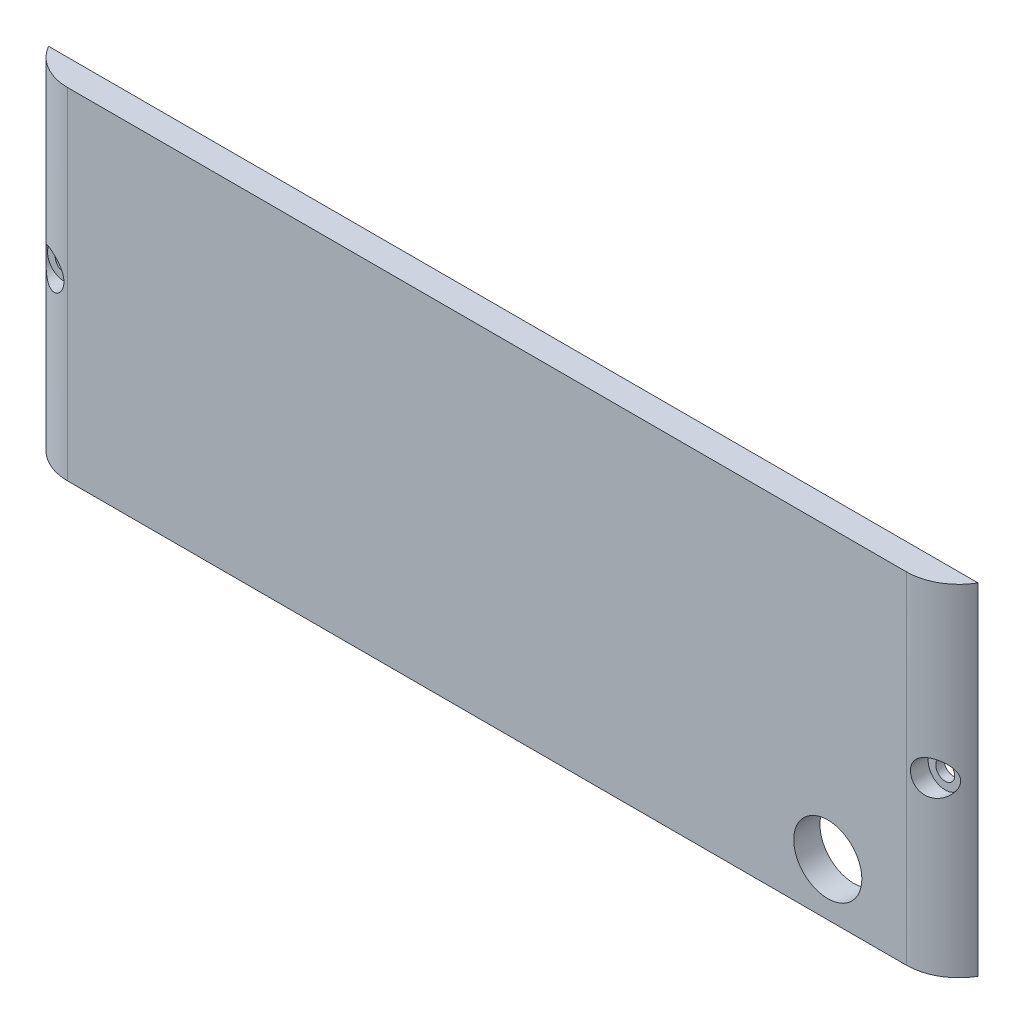
ISO-10303-21;
HEADER;
FILE_DESCRIPTION(('STEP AP214'),'2;1');
FILE_NAME('part.step','',(''),(''),'','','');
FILE_SCHEMA(('AUTOMOTIVE_DESIGN { 1 0 10303 214 1 1 1 1 }'));
ENDSEC;
DATA;
#1=APPLICATION_CONTEXT('core data for automotive mechanical design processes');
#2=APPLICATION_PROTOCOL_DEFINITION('international standard','automotive_design',2000,#1);
#3=PRODUCT_CONTEXT('',#1,'mechanical');
#4=PRODUCT('Part','Part','',(#3));
#5=PRODUCT_RELATED_PRODUCT_CATEGORY('part','',(#4));
#6=PRODUCT_DEFINITION_FORMATION('','',#4);
#7=PRODUCT_DEFINITION_CONTEXT('part definition',#1,'design');
#8=PRODUCT_DEFINITION('design','',#6,#7);
#9=PRODUCT_DEFINITION_SHAPE('','',#8);
#10=(LENGTH_UNIT() NAMED_UNIT(*) SI_UNIT(.MILLI.,.METRE.));
#11=(NAMED_UNIT(*) PLANE_ANGLE_UNIT() SI_UNIT($,.RADIAN.));
#12=(NAMED_UNIT(*) SI_UNIT($,.STERADIAN.) SOLID_ANGLE_UNIT());
#13=UNCERTAINTY_MEASURE_WITH_UNIT(LENGTH_MEASURE(1.E-05),#10,'distance_accuracy_value','');
#14=(GEOMETRIC_REPRESENTATION_CONTEXT(3) GLOBAL_UNCERTAINTY_ASSIGNED_CONTEXT((#13)) GLOBAL_UNIT_ASSIGNED_CONTEXT((#10,
#11,#12)) REPRESENTATION_CONTEXT('',''));
#15=CARTESIAN_POINT('',(0.,0.,0.));
#16=DIRECTION('',(0.,0.,1.));
#17=DIRECTION('',(1.,0.,0.));
#18=AXIS2_PLACEMENT_3D('',#15,#16,#17);
#19=CARTESIAN_POINT('',(0.,0.,5.));
#20=DIRECTION('',(0.,0.,-1.));
#21=DIRECTION('',(-1.,0.,0.));
#22=AXIS2_PLACEMENT_3D('',#19,#20,#21);
#23=PLANE('',#22);
#24=CARTESIAN_POINT('',(64.9999999999999,-22.5,5.));
#25=DIRECTION('',(0.,0.,1.));
#26=DIRECTION('',(1.,0.,0.));
#27=AXIS2_PLACEMENT_3D('',#24,#25,#26);
#28=CIRCLE('',#27,6.5);
#29=CARTESIAN_POINT('',(71.4999999999999,-22.5,5.));
#30=VERTEX_POINT('',#29);
#31=EDGE_CURVE('E318',#30,#30,#28,.T.);
#32=ORIENTED_EDGE('',*,*,#31,.F.);
#33=EDGE_LOOP('',(#32));
#34=FACE_BOUND('',#33,.T.);
#35=DIRECTION('',(0.,1.,0.));
#36=VECTOR('',#35,1.);
#37=CARTESIAN_POINT('',(79.9999999999999,-32.5,4.99999999999998));
#38=LINE('',#37,#36);
#39=CARTESIAN_POINT('',(79.9999999999999,-32.5,4.99999999999998));
#40=VERTEX_POINT('',#39);
#41=CARTESIAN_POINT('',(79.9999999999999,32.5,4.99999999999998));
#42=VERTEX_POINT('',#41);
#43=EDGE_CURVE('E88',#40,#42,#38,.T.);
#44=ORIENTED_EDGE('',*,*,#43,.T.);
#45=DIRECTION('',(-1.,0.,0.));
#46=VECTOR('',#45,1.);
#47=CARTESIAN_POINT('',(90.,32.5,5.));
#48=LINE('',#47,#46);
#49=CARTESIAN_POINT('',(-79.9999999999999,32.5,5.));
#50=VERTEX_POINT('',#49);
#51=EDGE_CURVE('E11',#42,#50,#48,.T.);
#52=ORIENTED_EDGE('',*,*,#51,.T.);
#53=DIRECTION('',(0.,1.,0.));
#54=VECTOR('',#53,1.);
#55=CARTESIAN_POINT('',(-79.9999999999999,-32.5,5.));
#56=LINE('',#55,#54);
#57=CARTESIAN_POINT('',(-79.9999999999999,-32.5,5.));
#58=VERTEX_POINT('',#57);
#59=EDGE_CURVE('E106',#58,#50,#56,.T.);
#60=ORIENTED_EDGE('',*,*,#59,.F.);
#61=DIRECTION('',(1.,0.,0.));
#62=VECTOR('',#61,1.);
#63=CARTESIAN_POINT('',(90.,-32.5,5.));
#64=LINE('',#63,#62);
#65=EDGE_CURVE('E56',#58,#40,#64,.T.);
#66=ORIENTED_EDGE('',*,*,#65,.T.);
#67=EDGE_LOOP('',(#44,#52,#60,#66));
#68=FACE_BOUND('',#67,.T.);
#69=ADVANCED_FACE('F42',(#34,#68),#23,.F.);
#70=CARTESIAN_POINT('',(90.,-32.5,5.));
#71=DIRECTION('',(0.,1.,0.));
#72=DIRECTION('',(-1.,0.,0.));
#73=AXIS2_PLACEMENT_3D('',#70,#71,#72);
#74=PLANE('',#73);
#75=DIRECTION('',(1.,0.,0.));
#76=VECTOR('',#75,1.);
#77=CARTESIAN_POINT('',(90.,-32.5,0.));
#78=LINE('',#77,#76);
#79=CARTESIAN_POINT('',(-88.6602540378444,-32.5,0.));
#80=VERTEX_POINT('',#79);
#81=CARTESIAN_POINT('',(88.6602540378444,-32.5,0.));
#82=VERTEX_POINT('',#81);
#83=EDGE_CURVE('E103',#80,#82,#78,.T.);
#84=ORIENTED_EDGE('',*,*,#83,.T.);
#85=CARTESIAN_POINT('',(80.,-32.5,-5.00000000000002));
#86=DIRECTION('',(0.,-1.,0.));
#87=DIRECTION('',(-1.,0.,0.));
#88=AXIS2_PLACEMENT_3D('',#85,#86,#87);
#89=CIRCLE('',#88,10.);
#90=EDGE_CURVE('E64',#82,#40,#89,.T.);
#91=ORIENTED_EDGE('',*,*,#90,.T.);
#92=ORIENTED_EDGE('',*,*,#65,.F.);
#93=CARTESIAN_POINT('',(-80.,-32.5,-5.));
#94=DIRECTION('',(0.,-1.,0.));
#95=DIRECTION('',(1.,0.,0.));
#96=AXIS2_PLACEMENT_3D('',#93,#94,#95);
#97=CIRCLE('',#96,10.);
#98=EDGE_CURVE('E166',#58,#80,#97,.T.);
#99=ORIENTED_EDGE('',*,*,#98,.T.);
#100=EDGE_LOOP('',(#84,#91,#92,#99));
#101=FACE_BOUND('',#100,.T.);
#102=ADVANCED_FACE('F44',(#101),#74,.F.);
#103=CARTESIAN_POINT('',(90.,32.5,5.));
#104=DIRECTION('',(0.,-1.,0.));
#105=DIRECTION('',(1.,0.,0.));
#106=AXIS2_PLACEMENT_3D('',#103,#104,#105);
#107=PLANE('',#106);
#108=ORIENTED_EDGE('',*,*,#51,.F.);
#109=CARTESIAN_POINT('',(80.,32.5,-5.00000000000002));
#110=DIRECTION('',(0.,-1.,0.));
#111=DIRECTION('',(-1.,0.,0.));
#112=AXIS2_PLACEMENT_3D('',#109,#110,#111);
#113=CIRCLE('',#112,10.);
#114=CARTESIAN_POINT('',(88.6602540378444,32.5,0.));
#115=VERTEX_POINT('',#114);
#116=EDGE_CURVE('E92',#115,#42,#113,.T.);
#117=ORIENTED_EDGE('',*,*,#116,.F.);
#118=DIRECTION('',(-1.,0.,0.));
#119=VECTOR('',#118,1.);
#120=CARTESIAN_POINT('',(90.,32.5,0.));
#121=LINE('',#120,#119);
#122=CARTESIAN_POINT('',(-88.6602540378443,32.5,0.));
#123=VERTEX_POINT('',#122);
#124=EDGE_CURVE('E107',#115,#123,#121,.T.);
#125=ORIENTED_EDGE('',*,*,#124,.T.);
#126=CARTESIAN_POINT('',(-80.,32.5,-5.));
#127=DIRECTION('',(0.,-1.,0.));
#128=DIRECTION('',(1.,0.,0.));
#129=AXIS2_PLACEMENT_3D('',#126,#127,#128);
#130=CIRCLE('',#129,10.);
#131=EDGE_CURVE('E72',#50,#123,#130,.T.);
#132=ORIENTED_EDGE('',*,*,#131,.F.);
#133=EDGE_LOOP('',(#108,#117,#125,#132));
#134=FACE_BOUND('',#133,.T.);
#135=ADVANCED_FACE('F152',(#134),#107,.F.);
#136=CARTESIAN_POINT('',(0.,0.,0.));
#137=DIRECTION('',(0.,0.,-1.));
#138=DIRECTION('',(-1.,0.,0.));
#139=AXIS2_PLACEMENT_3D('',#136,#137,#138);
#140=PLANE('',#139);
#141=CARTESIAN_POINT('',(64.9999999999999,-22.5,0.));
#142=DIRECTION('',(0.,0.,1.));
#143=DIRECTION('',(1.,0.,0.));
#144=AXIS2_PLACEMENT_3D('',#141,#142,#143);
#145=CIRCLE('',#144,6.5);
#146=CARTESIAN_POINT('',(71.4999999999999,-22.5,0.));
#147=VERTEX_POINT('',#146);
#148=EDGE_CURVE('E316',#147,#147,#145,.T.);
#149=ORIENTED_EDGE('',*,*,#148,.T.);
#150=EDGE_LOOP('',(#149));
#151=FACE_BOUND('',#150,.T.);
#152=DIRECTION('',(0.,1.,0.));
#153=VECTOR('',#152,1.);
#154=CARTESIAN_POINT('',(88.6602540378444,-32.5,0.));
#155=LINE('',#154,#153);
#156=EDGE_CURVE('E173',#82,#115,#155,.T.);
#157=ORIENTED_EDGE('',*,*,#156,.F.);
#158=ORIENTED_EDGE('',*,*,#83,.F.);
#159=DIRECTION('',(0.,1.,0.));
#160=VECTOR('',#159,1.);
#161=CARTESIAN_POINT('',(-88.6602540378444,-32.5,0.));
#162=LINE('',#161,#160);
#163=EDGE_CURVE('E129',#123,#80,#162,.F.);
#164=ORIENTED_EDGE('',*,*,#163,.F.);
#165=ORIENTED_EDGE('',*,*,#124,.F.);
#166=EDGE_LOOP('',(#157,#158,#164,#165));
#167=FACE_BOUND('',#166,.T.);
#168=CARTESIAN_POINT('',(-84.,0.,0.));
#169=DIRECTION('',(0.,0.,-1.));
#170=DIRECTION('',(-1.,0.,0.));
#171=AXIS2_PLACEMENT_3D('',#168,#169,#170);
#172=CIRCLE('',#171,1.8);
#173=CARTESIAN_POINT('',(-85.8,0.,0.));
#174=VERTEX_POINT('',#173);
#175=EDGE_CURVE('E119',#174,#174,#172,.T.);
#176=ORIENTED_EDGE('',*,*,#175,.F.);
#177=EDGE_LOOP('',(#176));
#178=FACE_BOUND('',#177,.T.);
#179=CARTESIAN_POINT('',(84.,0.,0.));
#180=DIRECTION('',(0.,0.,-1.));
#181=DIRECTION('',(-1.,0.,0.));
#182=AXIS2_PLACEMENT_3D('',#179,#180,#181);
#183=CIRCLE('',#182,1.8);
#184=CARTESIAN_POINT('',(82.2,0.,0.));
#185=VERTEX_POINT('',#184);
#186=EDGE_CURVE('E115',#185,#185,#183,.T.);
#187=ORIENTED_EDGE('',*,*,#186,.F.);
#188=EDGE_LOOP('',(#187));
#189=FACE_BOUND('',#188,.T.);
#190=ADVANCED_FACE('F158',(#151,#167,#178,#189),#140,.T.);
#191=CARTESIAN_POINT('',(84.,0.,5.));
#192=DIRECTION('',(0.,0.,1.));
#193=DIRECTION('',(1.,0.,0.));
#194=AXIS2_PLACEMENT_3D('',#191,#192,#193);
#195=CYLINDRICAL_SURFACE('',#194,1.8);
#196=ORIENTED_EDGE('',*,*,#186,.T.);
#197=EDGE_LOOP('',(#196));
#198=FACE_BOUND('',#197,.T.);
#199=CARTESIAN_POINT('',(84.,0.,1.6));
#200=DIRECTION('',(0.,0.,1.));
#201=DIRECTION('',(1.,0.,0.));
#202=AXIS2_PLACEMENT_3D('',#199,#200,#201);
#203=CIRCLE('',#202,1.8);
#204=CARTESIAN_POINT('',(85.8,0.,1.6));
#205=VERTEX_POINT('',#204);
#206=EDGE_CURVE('E112',#205,#205,#203,.T.);
#207=ORIENTED_EDGE('',*,*,#206,.T.);
#208=EDGE_LOOP('',(#207));
#209=FACE_BOUND('',#208,.T.);
#210=ADVANCED_FACE('F156',(#198,#209),#195,.F.);
#211=CARTESIAN_POINT('',(85.8,0.,1.6));
#212=DIRECTION('',(0.,0.,-1.));
#213=DIRECTION('',(-1.,0.,0.));
#214=AXIS2_PLACEMENT_3D('',#211,#212,#213);
#215=PLANE('',#214);
#216=ORIENTED_EDGE('',*,*,#206,.F.);
#217=EDGE_LOOP('',(#216));
#218=FACE_BOUND('',#217,.T.);
#219=CARTESIAN_POINT('',(84.,0.,1.6));
#220=DIRECTION('',(0.,0.,1.));
#221=DIRECTION('',(1.,0.,0.));
#222=AXIS2_PLACEMENT_3D('',#219,#220,#221);
#223=CIRCLE('',#222,3.24999999999999);
#224=CARTESIAN_POINT('',(87.25,0.,1.6));
#225=VERTEX_POINT('',#224);
#226=EDGE_CURVE('E121',#225,#225,#223,.T.);
#227=ORIENTED_EDGE('',*,*,#226,.T.);
#228=EDGE_LOOP('',(#227));
#229=FACE_BOUND('',#228,.T.);
#230=ADVANCED_FACE('F186',(#218,#229),#215,.F.);
#231=CARTESIAN_POINT('',(84.,0.,5.));
#232=DIRECTION('',(0.,0.,1.));
#233=DIRECTION('',(1.,0.,0.));
#234=AXIS2_PLACEMENT_3D('',#231,#232,#233);
#235=CYLINDRICAL_SURFACE('',#234,3.24999999999999);
#236=CARTESIAN_POINT('',(87.25,0.,1.88748865697794));
#237=CARTESIAN_POINT('',(87.2499994490645,0.0739982902647553,1.88748949602639));
#238=CARTESIAN_POINT('',(87.2474660038287,0.148023316325716,1.89015904051049));
#239=CARTESIAN_POINT('',(87.2373920388154,0.295390910229364,1.90073967900104));
#240=CARTESIAN_POINT('',(87.2298477045243,0.368732914962322,1.90865476613973));
#241=CARTESIAN_POINT('',(87.2099031709888,0.514221604282378,1.92946630024935));
#242=CARTESIAN_POINT('',(87.1974911282338,0.58636492270427,1.94237489576072));
#243=CARTESIAN_POINT('',(87.1680785909826,0.728748061257662,1.97273942809467));
#244=CARTESIAN_POINT('',(87.1510755898218,0.798986818374978,1.99019784894149));
#245=CARTESIAN_POINT('',(87.0940683799216,1.00463314056763,2.04819885998978));
#246=CARTESIAN_POINT('',(87.047815346268,1.13671157041791,2.09463713112362));
#247=CARTESIAN_POINT('',(86.9410674355679,1.38980442278871,2.19910830230638));
#248=CARTESIAN_POINT('',(86.880568562788,1.51081572790962,2.25714445468586));
#249=CARTESIAN_POINT('',(86.7144285804897,1.79831096101184,2.41180196373468));
#250=CARTESIAN_POINT('',(86.6012357564244,1.9578051976291,2.51334120236726));
#251=CARTESIAN_POINT('',(86.3520407947369,2.25112004017155,2.72518323318272));
#252=CARTESIAN_POINT('',(86.2159996427268,2.38489587847482,2.83550084228217));
#253=CARTESIAN_POINT('',(85.9212259758405,2.62842402308829,3.06065490389207));
#254=CARTESIAN_POINT('',(85.7621087747106,2.73766716011384,3.17553743690887));
#255=CARTESIAN_POINT('',(85.4255427093748,2.92703742489397,3.40265469542226));
#256=CARTESIAN_POINT('',(85.248096443733,3.00716867266808,3.51488979348946));
#257=CARTESIAN_POINT('',(84.9621326652843,3.10615932839382,3.68280111904894));
#258=CARTESIAN_POINT('',(84.8588977111595,3.13631960776782,3.74102078904331));
#259=CARTESIAN_POINT('',(84.6485222944809,3.18647130576145,3.85468791696575));
#260=CARTESIAN_POINT('',(84.5413836129166,3.20646730086999,3.91013661237215));
#261=CARTESIAN_POINT('',(84.3240020368341,3.23566803435699,4.01763339057597));
#262=CARTESIAN_POINT('',(84.2137599634525,3.24487560030383,4.06968236103795));
#263=CARTESIAN_POINT('',(83.9911354998814,3.25189420108598,4.16982669047982));
#264=CARTESIAN_POINT('',(83.8787535238983,3.24970741954844,4.2179228051955));
#265=CARTESIAN_POINT('',(83.6661122438884,3.23435177731438,4.30436638766453));
#266=CARTESIAN_POINT('',(83.5659549823843,3.22248301133684,4.34319791228157));
#267=CARTESIAN_POINT('',(83.3658654589353,3.18914645646286,4.41712898709472));
#268=CARTESIAN_POINT('',(83.265933161007,3.16768033137511,4.45222918285315));
#269=CARTESIAN_POINT('',(83.0674237235064,3.11501819168274,4.51850065489413));
#270=CARTESIAN_POINT('',(82.9688455862923,3.0838297909902,4.54967497895728));
#271=CARTESIAN_POINT('',(82.7741046597179,3.01171993066548,4.60805250822144));
#272=CARTESIAN_POINT('',(82.6779415659308,2.9707997046508,4.63525621603766));
#273=CARTESIAN_POINT('',(82.501641291839,2.88543090909036,4.68240629224696));
#274=CARTESIAN_POINT('',(82.4210620277849,2.84215768725872,4.70283661264364));
#275=CARTESIAN_POINT('',(82.2633260190346,2.74861304463658,4.74083867336138));
#276=CARTESIAN_POINT('',(82.1861703472566,2.69833945014464,4.75840952209203));
#277=CARTESIAN_POINT('',(82.0360809947966,2.59114210157604,4.79082559498984));
#278=CARTESIAN_POINT('',(81.9631448832096,2.53422223466253,4.80567239941455));
#279=CARTESIAN_POINT('',(81.8221182586382,2.41411013376238,4.83285562468033));
#280=CARTESIAN_POINT('',(81.7540295308738,2.35091560922044,4.84519112372309));
#281=CARTESIAN_POINT('',(81.564322911341,2.15897800510915,4.8776915151516));
#282=CARTESIAN_POINT('',(81.4498196254816,2.02252590171412,4.89488217356677));
#283=CARTESIAN_POINT('',(81.2444666212765,1.73239108378265,4.92280744087596));
#284=CARTESIAN_POINT('',(81.1536167570604,1.57870847551496,4.93354208958468));
#285=CARTESIAN_POINT('',(80.9976488921822,1.2571878262398,4.95042272350023));
#286=CARTESIAN_POINT('',(80.9327187542299,1.08925676891452,4.95653548511993));
#287=CARTESIAN_POINT('',(80.8314304451484,0.744909197974239,4.96550702164779));
#288=CARTESIAN_POINT('',(80.7950741227043,0.568492136110333,4.96836558601942));
#289=CARTESIAN_POINT('',(80.7517047069133,0.209929953572049,4.97173159547445));
#290=CARTESIAN_POINT('',(80.7450453378134,0.0277416823011363,4.9722107061747));
#291=CARTESIAN_POINT('',(80.7622297067573,-0.335187048795405,4.97091146616218));
#292=CARTESIAN_POINT('',(80.7860746052609,-0.515927453277281,4.9691330295666));
#293=CARTESIAN_POINT('',(80.8636942891681,-0.871359524814113,4.96270739034012));
#294=CARTESIAN_POINT('',(80.9175545529543,-1.04603239651563,4.95805199049019));
#295=CARTESIAN_POINT('',(81.0536769269325,-1.38377214933641,4.94456709572932));
#296=CARTESIAN_POINT('',(81.1359386255271,-1.54683919860748,4.93573766130836));
#297=CARTESIAN_POINT('',(81.3258993412196,-1.85591880391201,4.9121678795648));
#298=CARTESIAN_POINT('',(81.4334800265091,-2.0020061103563,4.89745481307335));
#299=CARTESIAN_POINT('',(81.6708009883032,-2.27373191036255,4.86016243838741));
#300=CARTESIAN_POINT('',(81.8005376842913,-2.39937370161996,4.83758440059756));
#301=CARTESIAN_POINT('',(82.0758671626396,-2.62516297928077,4.78315692684772));
#302=CARTESIAN_POINT('',(82.2212217148525,-2.72563234372702,4.75143703931312));
#303=CARTESIAN_POINT('',(82.5241770911656,-2.90087377207861,4.6774381268821));
#304=CARTESIAN_POINT('',(82.6817767627378,-2.9756482508391,4.63516009490578));
#305=CARTESIAN_POINT('',(83.0037622766521,-3.0983348298068,4.53968399510787));
#306=CARTESIAN_POINT('',(83.1681425247189,-3.1462686169824,4.48649479100882));
#307=CARTESIAN_POINT('',(83.4987235501278,-3.21555140226545,4.36961553834898));
#308=CARTESIAN_POINT('',(83.6649247447591,-3.23689417253997,4.30592303378338));
#309=CARTESIAN_POINT('',(84.0036662618076,-3.25465795775322,4.16548201541702));
#310=CARTESIAN_POINT('',(84.1760618404178,-3.24966531734899,4.08821292665844));
#311=CARTESIAN_POINT('',(84.513926158303,-3.21360913094273,3.92522951569884));
#312=CARTESIAN_POINT('',(84.6793927034015,-3.18253739119697,3.83951254674521));
#313=CARTESIAN_POINT('',(85.0197027795892,-3.09149405373475,3.65128560757514));
#314=CARTESIAN_POINT('',(85.1933056784492,-3.02851386105056,3.5479927229116));
#315=CARTESIAN_POINT('',(85.5255286807376,-2.87554743983906,3.33710692706942));
#316=CARTESIAN_POINT('',(85.6841303516089,-2.78552854044128,3.22950895115399));
#317=CARTESIAN_POINT('',(86.0039586728963,-2.56690913810534,2.99975964446332));
#318=CARTESIAN_POINT('',(86.1627538652501,-2.43477890652404,2.8775671758994));
#319=CARTESIAN_POINT('',(86.4549538248708,-2.13980039145733,2.63995365975544));
#320=CARTESIAN_POINT('',(86.5883831842904,-1.97698216817041,2.52452612947011));
#321=CARTESIAN_POINT('',(86.7889970944861,-1.6751424173754,2.34315562776024));
#322=CARTESIAN_POINT('',(86.8639894300642,-1.5439318298669,2.27283618553261));
#323=CARTESIAN_POINT('',(86.9967164881924,-1.26714027799061,2.14523689987004));
#324=CARTESIAN_POINT('',(87.0544767511753,-1.12158101078815,2.08793778876133));
#325=CARTESIAN_POINT('',(87.140431667704,-0.846667988082033,2.00123259157677));
#326=CARTESIAN_POINT('',(87.1721493023736,-0.719442576729664,1.96860284795026));
#327=CARTESIAN_POINT('',(87.2200782158581,-0.459297429881586,1.91893785654021));
#328=CARTESIAN_POINT('',(87.2363349769141,-0.326395605927594,1.90185687436178));
#329=CARTESIAN_POINT('',(87.2461888194016,-0.160624114583075,1.89149808403918));
#330=CARTESIAN_POINT('',(87.2476164149723,-0.128540569164138,1.88999682607956));
#331=CARTESIAN_POINT('',(87.2495221903598,-0.0643063710992572,1.88799186154628));
#332=CARTESIAN_POINT('',(87.2500002394072,-0.0321557098205085,1.88748829237223));
#333=CARTESIAN_POINT('',(87.25,0.,1.88748865697794));
#334=B_SPLINE_CURVE_WITH_KNOTS('',3,(#236,#237,#238,#239,#240,#241,#242,#243,#244,#245,#246,
#247,#248,#249,#250,#251,#252,#253,#254,#255,#256,#257,#258,#259,#260,#261,#262,#263,#264,#265,
#266,#267,#268,#269,#270,#271,#272,#273,#274,#275,#276,#277,#278,#279,#280,#281,#282,#283,#284,
#285,#286,#287,#288,#289,#290,#291,#292,#293,#294,#295,#296,#297,#298,#299,#300,#301,#302,#303,
#304,#305,#306,#307,#308,#309,#310,#311,#312,#313,#314,#315,#316,#317,#318,#319,#320,#321,#322,
#323,#324,#325,#326,#327,#328,#329,#330,#331,#332,#333),.UNSPECIFIED.,.T.,.F.,(4,2,2,2,2,2,2,2,
2,2,2,2,2,2,2,2,2,2,2,2,2,2,2,2,2,2,2,2,2,2,2,2,2,2,2,2,2,2,2,2,2,2,2,2,2,2,2,2,4),(0.,
0.221950964959526,0.444071082894586,0.666735022978144,0.889520784350385,1.32982636652641,
1.77025559489705,2.42779267942715,3.08646416622115,3.75775056870203,4.4289419312684,
4.79540005381448,5.1616930313961,5.52788998477757,5.89401676229383,6.21777646238711,
6.54148005689428,6.86493078004882,7.18834052404643,7.46913668158138,7.75002022500542,
8.03074030503446,8.31156324096572,8.84569110128984,9.37981566757353,9.91774411506878,
10.4557073629022,11.0000615350031,11.544436416337,12.09036956098,12.6362947942202,
13.1797175359838,13.723052541013,14.2590376940323,14.7949724603424,15.3304735703984,
15.8661000756174,16.4307614476731,16.9956002960752,17.6279051451361,18.2609771028008,
18.9778477849699,19.6940198771362,20.1924934965223,20.6902245927211,21.0939914986637,
21.4965669096869,21.5930016801432,21.6894497304709),.UNSPECIFIED.);
#335=CARTESIAN_POINT('',(87.25,0.,1.88748865697794));
#336=VERTEX_POINT('',#335);
#337=EDGE_CURVE('E46',#336,#336,#334,.T.);
#338=ORIENTED_EDGE('',*,*,#337,.T.);
#339=EDGE_LOOP('',(#338));
#340=FACE_BOUND('',#339,.T.);
#341=ORIENTED_EDGE('',*,*,#226,.F.);
#342=EDGE_LOOP('',(#341));
#343=FACE_BOUND('',#342,.T.);
#344=ADVANCED_FACE('F188',(#340,#343),#235,.F.);
#345=CARTESIAN_POINT('',(-84.,0.,5.));
#346=DIRECTION('',(0.,0.,1.));
#347=DIRECTION('',(1.,0.,0.));
#348=AXIS2_PLACEMENT_3D('',#345,#346,#347);
#349=CYLINDRICAL_SURFACE('',#348,1.8);
#350=ORIENTED_EDGE('',*,*,#175,.T.);
#351=EDGE_LOOP('',(#350));
#352=FACE_BOUND('',#351,.T.);
#353=CARTESIAN_POINT('',(-84.,0.,1.6));
#354=DIRECTION('',(0.,0.,1.));
#355=DIRECTION('',(1.,0.,0.));
#356=AXIS2_PLACEMENT_3D('',#353,#354,#355);
#357=CIRCLE('',#356,1.8);
#358=CARTESIAN_POINT('',(-82.2,0.,1.6));
#359=VERTEX_POINT('',#358);
#360=EDGE_CURVE('E122',#359,#359,#357,.T.);
#361=ORIENTED_EDGE('',*,*,#360,.T.);
#362=EDGE_LOOP('',(#361));
#363=FACE_BOUND('',#362,.T.);
#364=ADVANCED_FACE('F193',(#352,#363),#349,.F.);
#365=CARTESIAN_POINT('',(-82.2,0.,1.6));
#366=DIRECTION('',(0.,0.,-1.));
#367=DIRECTION('',(-1.,0.,0.));
#368=AXIS2_PLACEMENT_3D('',#365,#366,#367);
#369=PLANE('',#368);
#370=ORIENTED_EDGE('',*,*,#360,.F.);
#371=EDGE_LOOP('',(#370));
#372=FACE_BOUND('',#371,.T.);
#373=CARTESIAN_POINT('',(-84.,0.,1.6));
#374=DIRECTION('',(0.,0.,1.));
#375=DIRECTION('',(1.,0.,0.));
#376=AXIS2_PLACEMENT_3D('',#373,#374,#375);
#377=CIRCLE('',#376,3.24999999999999);
#378=CARTESIAN_POINT('',(-80.75,0.,1.6));
#379=VERTEX_POINT('',#378);
#380=EDGE_CURVE('E175',#379,#379,#377,.T.);
#381=ORIENTED_EDGE('',*,*,#380,.T.);
#382=EDGE_LOOP('',(#381));
#383=FACE_BOUND('',#382,.T.);
#384=ADVANCED_FACE('F199',(#372,#383),#369,.F.);
#385=CARTESIAN_POINT('',(-84.,0.,5.));
#386=DIRECTION('',(0.,0.,1.));
#387=DIRECTION('',(1.,0.,0.));
#388=AXIS2_PLACEMENT_3D('',#385,#386,#387);
#389=CYLINDRICAL_SURFACE('',#388,3.24999999999999);
#390=CARTESIAN_POINT('',(-80.75,0.,4.97183533758957));
#391=CARTESIAN_POINT('',(-80.7500000354527,0.181729237585233,4.97183501793272));
#392=CARTESIAN_POINT('',(-80.7652787769368,0.363454510103201,4.97072141235285));
#393=CARTESIAN_POINT('',(-80.8259541199082,0.721766305106831,4.96587754278699));
#394=CARTESIAN_POINT('',(-80.871349323803,0.8983530656547,4.96214740022425));
#395=CARTESIAN_POINT('',(-80.990952575155,1.24142776944402,4.9509596306358));
#396=CARTESIAN_POINT('',(-81.0651695973721,1.40791254836339,4.94350084234761));
#397=CARTESIAN_POINT('',(-81.240176454244,1.72592159032894,4.92318936084757));
#398=CARTESIAN_POINT('',(-81.3409650998759,1.87744652237913,4.91033690897531));
#399=CARTESIAN_POINT('',(-81.5651840510754,2.16021182562294,4.87739409260291));
#400=CARTESIAN_POINT('',(-81.6884643735695,2.29157653799414,4.85735087042634));
#401=CARTESIAN_POINT('',(-81.953963721757,2.53144814569366,4.8081701664452));
#402=CARTESIAN_POINT('',(-82.0961793826856,2.63995909325762,4.77903429914887));
#403=CARTESIAN_POINT('',(-82.3926027807961,2.83008247721733,4.71072813646079));
#404=CARTESIAN_POINT('',(-82.5466246915915,2.91203525642011,4.67169725773484));
#405=CARTESIAN_POINT('',(-82.8630566410859,3.04952906913857,4.58279177479097));
#406=CARTESIAN_POINT('',(-83.025466726165,3.1050699565995,4.53291711061038));
#407=CARTESIAN_POINT('',(-83.3558667309396,3.19016037425395,4.42172847487054));
#408=CARTESIAN_POINT('',(-83.5239033550995,3.21932312094348,4.36025976010466));
#409=CARTESIAN_POINT('',(-83.8585067216528,3.25127057018507,4.22737111334339));
#410=CARTESIAN_POINT('',(-84.0250729351745,3.25404613951242,4.15594774448578));
#411=CARTESIAN_POINT('',(-84.3658672766997,3.23419989969475,3.99873003883074));
#412=CARTESIAN_POINT('',(-84.5396544037018,3.20954505349592,3.91224504466844));
#413=CARTESIAN_POINT('',(-84.8774172242735,3.13410594800884,3.7319823963186));
#414=CARTESIAN_POINT('',(-85.041390268324,3.0833146678414,3.6382027883697));
#415=CARTESIAN_POINT('',(-85.3781660253733,2.94961720783711,3.43321927297514));
#416=CARTESIAN_POINT('',(-85.5492238977303,2.86332824950044,3.3213608538421));
#417=CARTESIAN_POINT('',(-85.8733238849309,2.66262568446372,3.09586796882594));
#418=CARTESIAN_POINT('',(-86.0263306544814,2.54815821131038,2.98223049631911));
#419=CARTESIAN_POINT('',(-86.2477893660206,2.34971798549841,2.80866540200932));
#420=CARTESIAN_POINT('',(-86.3235283189904,2.27489875310466,2.74737735396609));
#421=CARTESIAN_POINT('',(-86.4681428145103,2.11712671927884,2.62705432994253));
#422=CARTESIAN_POINT('',(-86.5370162207769,2.0341714020532,2.56802005875117));
#423=CARTESIAN_POINT('',(-86.6670325730643,1.86042437101517,2.4537340162035));
#424=CARTESIAN_POINT('',(-86.7281960536971,1.76965460544527,2.39847238506013));
#425=CARTESIAN_POINT('',(-86.8421491008316,1.58015954819506,2.29321684345622));
#426=CARTESIAN_POINT('',(-86.8949414269889,1.48143689453622,2.24322119882994));
#427=CARTESIAN_POINT('',(-87.0000312688411,1.25712856625281,2.14183650015997));
#428=CARTESIAN_POINT('',(-87.0504168446937,1.12995860330385,2.09191236879371));
#429=CARTESIAN_POINT('',(-87.1355700705222,0.865928708404125,2.00623556279521));
#430=CARTESIAN_POINT('',(-87.1703603838932,0.729083174479871,1.97046233269859));
#431=CARTESIAN_POINT('',(-87.2092397853733,0.518160559593223,1.93016595310789));
#432=CARTESIAN_POINT('',(-87.220002770459,0.446518594624986,1.91893791612131));
#433=CARTESIAN_POINT('',(-87.2367439171642,0.302094939063971,1.90142659473381));
#434=CARTESIAN_POINT('',(-87.2427244969909,0.22931384347521,1.89514081132595));
#435=CARTESIAN_POINT('',(-87.2497555167708,0.0832613816791262,1.8877479660797));
#436=CARTESIAN_POINT('',(-87.2508068327075,0.00999010490016916,1.88663998409023));
#437=CARTESIAN_POINT('',(-87.2479652706707,-0.136327537710553,1.8896297396568));
#438=CARTESIAN_POINT('',(-87.244072761163,-0.209373919897104,1.8937270892568));
#439=CARTESIAN_POINT('',(-87.2266727871406,-0.408998648021694,1.91198193428551));
#440=CARTESIAN_POINT('',(-87.2081493169179,-0.534721282190015,1.93137389859645));
#441=CARTESIAN_POINT('',(-87.1574311850562,-0.780339540106101,1.98372929189524));
#442=CARTESIAN_POINT('',(-87.1252275649943,-0.90023128806953,2.01670161352558));
#443=CARTESIAN_POINT('',(-87.0343050000041,-1.17637198648124,2.10802962579182));
#444=CARTESIAN_POINT('',(-86.9701640933473,-1.32921950059461,2.17126912689398));
#445=CARTESIAN_POINT('',(-86.8229468595441,-1.61863838168974,2.31148235196894));
#446=CARTESIAN_POINT('',(-86.739826510988,-1.75517076743919,2.38848791370997));
#447=CARTESIAN_POINT('',(-86.5282414198817,-2.05271465182897,2.57679958064359));
#448=CARTESIAN_POINT('',(-86.3937816672011,-2.20754924918429,2.69118950113009));
#449=CARTESIAN_POINT('',(-86.1744709736608,-2.41752407786656,2.86668846404592));
#450=CARTESIAN_POINT('',(-86.0983705478657,-2.4838418111104,2.92588368053644));
#451=CARTESIAN_POINT('',(-85.9406089386421,-2.60896141578952,3.04480737915859));
#452=CARTESIAN_POINT('',(-85.8589476607296,-2.66776315947236,3.10453587033606));
#453=CARTESIAN_POINT('',(-85.6041329319489,-2.83383834971735,3.28475065763169));
#454=CARTESIAN_POINT('',(-85.4227324837908,-2.92926653220844,3.40497516472666));
#455=CARTESIAN_POINT('',(-85.1372331931055,-3.04627630390101,3.58029329961141));
#456=CARTESIAN_POINT('',(-85.039788538768,-3.08093348765871,3.63792011573364));
#457=CARTESIAN_POINT('',(-84.8408639863974,-3.14105543003416,3.75094717683172));
#458=CARTESIAN_POINT('',(-84.7393860699038,-3.16652464220748,3.80634848894076));
#459=CARTESIAN_POINT('',(-84.5324605401307,-3.20783073975766,3.91462385800207));
#460=CARTESIAN_POINT('',(-84.4269947006403,-3.22361573057158,3.96748292407487));
#461=CARTESIAN_POINT('',(-84.2134420706281,-3.24475661105321,4.06977996178036));
#462=CARTESIAN_POINT('',(-84.1053567091241,-3.25011806290524,4.11921974441123));
#463=CARTESIAN_POINT('',(-83.8875517252943,-3.24987806899059,4.21417641571506));
#464=CARTESIAN_POINT('',(-83.7778331289122,-3.24428323924971,4.25969565450724));
#465=CARTESIAN_POINT('',(-83.55786821593,-3.22168206377901,4.3464185497794));
#466=CARTESIAN_POINT('',(-83.4476220107969,-3.20467803119318,4.38762307908229));
#467=CARTESIAN_POINT('',(-83.2433048737299,-3.16215575907519,4.45996985541824));
#468=CARTESIAN_POINT('',(-83.1491277668629,-3.13816056060074,4.49171345951856));
#469=CARTESIAN_POINT('',(-82.962299087357,-3.08142877265843,4.55167021585053));
#470=CARTESIAN_POINT('',(-82.8696472929035,-3.04869346633486,4.57988388542331));
#471=CARTESIAN_POINT('',(-82.6868859608938,-2.97455069921122,4.63274056508749));
#472=CARTESIAN_POINT('',(-82.596775129229,-2.93314774677486,4.65738542022185));
#473=CARTESIAN_POINT('',(-82.4200365519682,-2.84184900257243,4.70318276761988));
#474=CARTESIAN_POINT('',(-82.3334085453224,-2.79195384879914,4.72433552199925));
#475=CARTESIAN_POINT('',(-82.1736474693904,-2.68978462825379,4.76121119427836));
#476=CARTESIAN_POINT('',(-82.1000624893841,-2.63833698482982,4.77727297032072));
#477=CARTESIAN_POINT('',(-81.9570695280562,-2.52923421189581,4.80689614134835));
#478=CARTESIAN_POINT('',(-81.8876629664158,-2.47157699093785,4.82045668969727));
#479=CARTESIAN_POINT('',(-81.7537007433572,-2.35048581413559,4.84526146088375));
#480=CARTESIAN_POINT('',(-81.6891425681946,-2.287054890052,4.85650688938263));
#481=CARTESIAN_POINT('',(-81.5653829504838,-2.15484469892209,4.87691814659773));
#482=CARTESIAN_POINT('',(-81.5061835088736,-2.08606345175686,4.88608320041717));
#483=CARTESIAN_POINT('',(-81.3399922869741,-1.87569216943688,4.9104375086402));
#484=CARTESIAN_POINT('',(-81.2411989137154,-1.72716432513606,4.92304772994871));
#485=CARTESIAN_POINT('',(-81.0691611051987,-1.41576375216728,4.94306000711247));
#486=CARTESIAN_POINT('',(-80.99591953533,-1.25288941724165,4.95046147895111));
#487=CARTESIAN_POINT('',(-80.8749513491056,-0.91132252751286,4.96184246324656));
#488=CARTESIAN_POINT('',(-80.8282087360951,-0.732275674875458,4.96569297843148));
#489=CARTESIAN_POINT('',(-80.7657322086802,-0.368818046094841,4.97068965059793));
#490=CARTESIAN_POINT('',(-80.749999964025,-0.184406981658876,4.97183566195649));
#491=CARTESIAN_POINT('',(-80.75,0.,4.97183533758957));
#492=B_SPLINE_CURVE_WITH_KNOTS('',3,(#390,#391,#392,#393,#394,#395,#396,#397,#398,#399,#400,
#401,#402,#403,#404,#405,#406,#407,#408,#409,#410,#411,#412,#413,#414,#415,#416,#417,#418,#419,
#420,#421,#422,#423,#424,#425,#426,#427,#428,#429,#430,#431,#432,#433,#434,#435,#436,#437,#438,
#439,#440,#441,#442,#443,#444,#445,#446,#447,#448,#449,#450,#451,#452,#453,#454,#455,#456,#457,
#458,#459,#460,#461,#462,#463,#464,#465,#466,#467,#468,#469,#470,#471,#472,#473,#474,#475,#476,
#477,#478,#479,#480,#481,#482,#483,#484,#485,#486,#487,#488,#489,#490,#491),.UNSPECIFIED.,.T.,
.F.,(4,2,2,2,2,2,2,2,2,2,2,2,2,2,2,2,2,2,2,2,2,2,2,2,2,2,2,2,2,2,2,2,2,2,2,2,2,2,2,2,2,2,2,2,2,
2,2,2,2,2,4),(0.,0.544540166356607,1.08905506440663,1.63373965383415,2.17839987393591,
2.71955269345072,3.26060947940771,3.79442992822782,4.3282533289795,4.86978295898581,
5.4115000183535,5.99620817410918,6.58107347869313,7.24403892849186,7.90828169027398,
8.2764136500024,8.64465980243727,9.01190345859664,9.37902579546547,9.814314295724,
10.2489681575338,10.4686183645188,10.6881574357598,10.9076574910595,11.1271411878668,
11.5109083792932,11.8949272683591,12.424203200527,12.9547194486107,13.6552477741497,
14.0060079947853,14.3567741766467,15.0658563774104,15.4207050578186,15.7753815055994,
16.1319423159152,16.4883128068118,16.8444681672996,17.2005513413419,17.5068426172357,
17.8130889508923,18.1191763885031,18.4252408408547,18.6985416303533,18.9719347598864,
19.2451851503638,19.5185371545816,20.052305504635,20.5861336924551,21.1386677992561,
21.6912316563665),.UNSPECIFIED.);
#493=CARTESIAN_POINT('',(-80.75,0.,4.97183533758957));
#494=VERTEX_POINT('',#493);
#495=EDGE_CURVE('E96',#494,#494,#492,.T.);
#496=ORIENTED_EDGE('',*,*,#495,.T.);
#497=EDGE_LOOP('',(#496));
#498=FACE_BOUND('',#497,.T.);
#499=ORIENTED_EDGE('',*,*,#380,.F.);
#500=EDGE_LOOP('',(#499));
#501=FACE_BOUND('',#500,.T.);
#502=ADVANCED_FACE('F130',(#498,#501),#389,.F.);
#503=CARTESIAN_POINT('',(-80.,-32.5,-5.));
#504=DIRECTION('',(0.,1.,0.));
#505=DIRECTION('',(-1.,0.,0.));
#506=AXIS2_PLACEMENT_3D('',#503,#504,#505);
#507=CYLINDRICAL_SURFACE('',#506,10.);
#508=ORIENTED_EDGE('',*,*,#163,.T.);
#509=ORIENTED_EDGE('',*,*,#98,.F.);
#510=ORIENTED_EDGE('',*,*,#59,.T.);
#511=ORIENTED_EDGE('',*,*,#131,.T.);
#512=EDGE_LOOP('',(#508,#509,#510,#511));
#513=FACE_BOUND('',#512,.T.);
#514=ORIENTED_EDGE('',*,*,#495,.F.);
#515=EDGE_LOOP('',(#514));
#516=FACE_BOUND('',#515,.T.);
#517=ADVANCED_FACE('F133',(#513,#516),#507,.T.);
#518=CARTESIAN_POINT('',(80.,-32.5,-5.00000000000002));
#519=DIRECTION('',(0.,1.,0.));
#520=DIRECTION('',(-1.,0.,0.));
#521=AXIS2_PLACEMENT_3D('',#518,#519,#520);
#522=CYLINDRICAL_SURFACE('',#521,10.);
#523=ORIENTED_EDGE('',*,*,#156,.T.);
#524=ORIENTED_EDGE('',*,*,#116,.T.);
#525=ORIENTED_EDGE('',*,*,#43,.F.);
#526=ORIENTED_EDGE('',*,*,#90,.F.);
#527=EDGE_LOOP('',(#523,#524,#525,#526));
#528=FACE_BOUND('',#527,.T.);
#529=ORIENTED_EDGE('',*,*,#337,.F.);
#530=EDGE_LOOP('',(#529));
#531=FACE_BOUND('',#530,.T.);
#532=ADVANCED_FACE('F89',(#528,#531),#522,.T.);
#533=CARTESIAN_POINT('',(64.9999999999999,-22.5,0.));
#534=DIRECTION('',(0.,0.,1.));
#535=DIRECTION('',(1.,0.,0.));
#536=AXIS2_PLACEMENT_3D('',#533,#534,#535);
#537=CYLINDRICAL_SURFACE('',#536,6.5);
#538=ORIENTED_EDGE('',*,*,#148,.F.);
#539=EDGE_LOOP('',(#538));
#540=FACE_BOUND('',#539,.T.);
#541=ORIENTED_EDGE('',*,*,#31,.T.);
#542=EDGE_LOOP('',(#541));
#543=FACE_BOUND('',#542,.T.);
#544=ADVANCED_FACE('F139',(#540,#543),#537,.F.);
#545=CLOSED_SHELL('',(#69,#102,#135,#190,#210,#230,#344,#364,#384,#502,#517,#532,#544));
#546=MANIFOLD_SOLID_BREP('B2',#545);
#547=ADVANCED_BREP_SHAPE_REPRESENTATION('',(#18,#546),#14);
#548=SHAPE_DEFINITION_REPRESENTATION(#9,#547);
ENDSEC;
END-ISO-10303-21;
